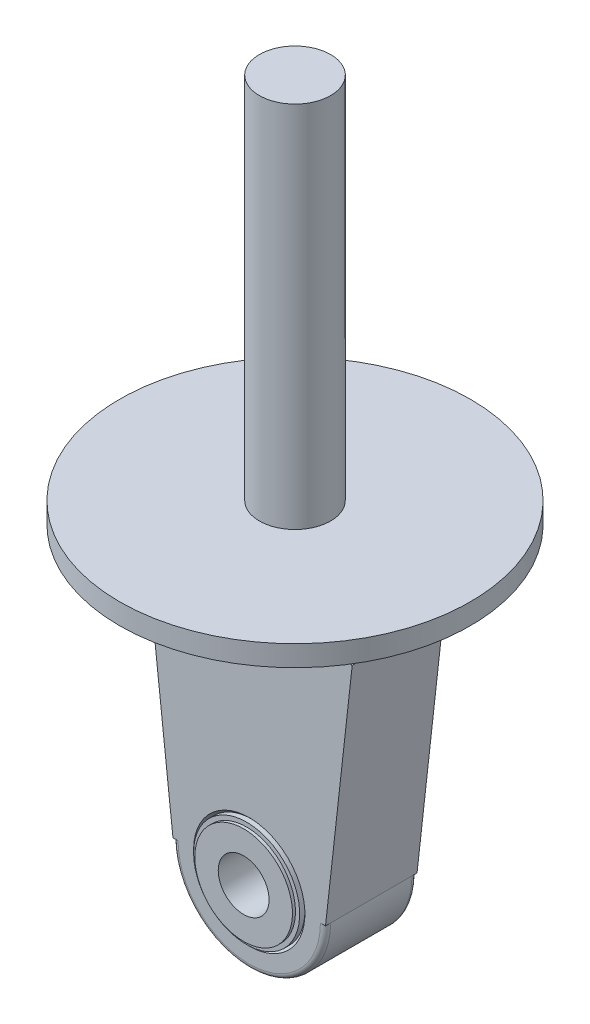
ISO-10303-21;
HEADER;
FILE_DESCRIPTION(('STEP AP214'),'2;1');
FILE_NAME('part.step','',(''),(''),'','','');
FILE_SCHEMA(('AUTOMOTIVE_DESIGN { 1 0 10303 214 1 1 1 1 }'));
ENDSEC;
DATA;
#1=APPLICATION_CONTEXT('core data for automotive mechanical design processes');
#2=APPLICATION_PROTOCOL_DEFINITION('international standard','automotive_design',2000,#1);
#3=PRODUCT_CONTEXT('',#1,'mechanical');
#4=PRODUCT('Part','Part','',(#3));
#5=PRODUCT_RELATED_PRODUCT_CATEGORY('part','',(#4));
#6=PRODUCT_DEFINITION_FORMATION('','',#4);
#7=PRODUCT_DEFINITION_CONTEXT('part definition',#1,'design');
#8=PRODUCT_DEFINITION('design','',#6,#7);
#9=PRODUCT_DEFINITION_SHAPE('','',#8);
#10=(LENGTH_UNIT() NAMED_UNIT(*) SI_UNIT(.MILLI.,.METRE.));
#11=(NAMED_UNIT(*) PLANE_ANGLE_UNIT() SI_UNIT($,.RADIAN.));
#12=(NAMED_UNIT(*) SI_UNIT($,.STERADIAN.) SOLID_ANGLE_UNIT());
#13=UNCERTAINTY_MEASURE_WITH_UNIT(LENGTH_MEASURE(1.E-05),#10,'distance_accuracy_value','');
#14=(GEOMETRIC_REPRESENTATION_CONTEXT(3) GLOBAL_UNCERTAINTY_ASSIGNED_CONTEXT((#13)) GLOBAL_UNIT_ASSIGNED_CONTEXT((#10,
#11,#12)) REPRESENTATION_CONTEXT('',''));
#15=CARTESIAN_POINT('',(0.,0.,0.));
#16=DIRECTION('',(0.,0.,1.));
#17=DIRECTION('',(1.,0.,0.));
#18=AXIS2_PLACEMENT_3D('',#15,#16,#17);
#19=CARTESIAN_POINT('',(-20.25,47.,71.0423242633607));
#20=DIRECTION('',(0.,-1.,0.));
#21=DIRECTION('',(1.,0.,0.));
#22=AXIS2_PLACEMENT_3D('',#19,#20,#21);
#23=PLANE('',#22);
#24=DIRECTION('',(1.,0.,0.));
#25=VECTOR('',#24,1.);
#26=CARTESIAN_POINT('',(-20.25,47.,-9.));
#27=LINE('',#26,#25);
#28=CARTESIAN_POINT('',(18.1400799336717,47.,-9.));
#29=VERTEX_POINT('',#28);
#30=CARTESIAN_POINT('',(20.25,47.,-9.));
#31=VERTEX_POINT('',#30);
#32=EDGE_CURVE('E139',#29,#31,#27,.T.);
#33=ORIENTED_EDGE('',*,*,#32,.F.);
#34=CARTESIAN_POINT('',(0.,47.,0.));
#35=DIRECTION('',(0.,-1.,0.));
#36=DIRECTION('',(0.,0.,-1.));
#37=AXIS2_PLACEMENT_3D('',#34,#35,#36);
#38=CIRCLE('',#37,20.25);
#39=CARTESIAN_POINT('',(20.25,47.,0.));
#40=VERTEX_POINT('',#39);
#41=EDGE_CURVE('E129',#29,#40,#38,.T.);
#42=ORIENTED_EDGE('',*,*,#41,.T.);
#43=DIRECTION('',(0.,0.,-1.));
#44=VECTOR('',#43,1.);
#45=CARTESIAN_POINT('',(20.25,47.,71.0423242633607));
#46=LINE('',#45,#44);
#47=EDGE_CURVE('E140',#40,#31,#46,.T.);
#48=ORIENTED_EDGE('',*,*,#47,.T.);
#49=EDGE_LOOP('',(#33,#42,#48));
#50=FACE_BOUND('',#49,.T.);
#51=ADVANCED_FACE('F40',(#50),#23,.F.);
#52=CARTESIAN_POINT('',(20.25,47.,9.));
#53=VERTEX_POINT('',#52);
#54=EDGE_CURVE('E185',#53,#40,#46,.T.);
#55=ORIENTED_EDGE('',*,*,#54,.T.);
#56=CARTESIAN_POINT('',(18.1400799336717,47.,9.));
#57=VERTEX_POINT('',#56);
#58=EDGE_CURVE('E11',#40,#57,#38,.T.);
#59=ORIENTED_EDGE('',*,*,#58,.T.);
#60=DIRECTION('',(1.,0.,0.));
#61=VECTOR('',#60,1.);
#62=CARTESIAN_POINT('',(-20.25,47.,9.));
#63=LINE('',#62,#61);
#64=EDGE_CURVE('E164',#57,#53,#63,.T.);
#65=ORIENTED_EDGE('',*,*,#64,.T.);
#66=EDGE_LOOP('',(#55,#59,#65));
#67=FACE_BOUND('',#66,.T.);
#68=ADVANCED_FACE('F280',(#67),#23,.F.);
#69=CARTESIAN_POINT('',(-20.25,47.,9.));
#70=VERTEX_POINT('',#69);
#71=CARTESIAN_POINT('',(-18.1400799336717,47.,9.));
#72=VERTEX_POINT('',#71);
#73=EDGE_CURVE('E166',#70,#72,#63,.T.);
#74=ORIENTED_EDGE('',*,*,#73,.T.);
#75=CARTESIAN_POINT('',(-20.25,47.,0.));
#76=VERTEX_POINT('',#75);
#77=EDGE_CURVE('E49',#72,#76,#38,.T.);
#78=ORIENTED_EDGE('',*,*,#77,.T.);
#79=DIRECTION('',(0.,0.,-1.));
#80=VECTOR('',#79,1.);
#81=CARTESIAN_POINT('',(-20.25,47.,71.0423242633607));
#82=LINE('',#81,#80);
#83=EDGE_CURVE('E182',#70,#76,#82,.T.);
#84=ORIENTED_EDGE('',*,*,#83,.F.);
#85=EDGE_LOOP('',(#74,#78,#84));
#86=FACE_BOUND('',#85,.T.);
#87=ADVANCED_FACE('F286',(#86),#23,.F.);
#88=CARTESIAN_POINT('',(0.,0.,-8.));
#89=DIRECTION('',(0.,0.,-1.));
#90=DIRECTION('',(-1.,0.,0.));
#91=AXIS2_PLACEMENT_3D('',#88,#89,#90);
#92=TOROIDAL_SURFACE('',#91,14.,0.999999999999999);
#93=CARTESIAN_POINT('',(-14.,0.,-8.));
#94=DIRECTION('',(0.,1.,0.));
#95=DIRECTION('',(0.,0.,1.));
#96=AXIS2_PLACEMENT_3D('',#93,#94,#95);
#97=CIRCLE('',#96,0.999999999999999);
#98=CARTESIAN_POINT('',(-14.,0.,-9.));
#99=VERTEX_POINT('',#98);
#100=CARTESIAN_POINT('',(-15.,0.,-7.99999999999999));
#101=VERTEX_POINT('',#100);
#102=EDGE_CURVE('E201',#99,#101,#97,.T.);
#103=ORIENTED_EDGE('',*,*,#102,.F.);
#104=CARTESIAN_POINT('',(0.,0.,-9.));
#105=DIRECTION('',(0.,0.,-1.));
#106=DIRECTION('',(-1.,0.,0.));
#107=AXIS2_PLACEMENT_3D('',#104,#105,#106);
#108=CIRCLE('',#107,14.);
#109=CARTESIAN_POINT('',(14.,0.,-9.));
#110=VERTEX_POINT('',#109);
#111=EDGE_CURVE('E66',#110,#99,#108,.T.);
#112=ORIENTED_EDGE('',*,*,#111,.F.);
#113=CARTESIAN_POINT('',(14.,0.,-8.));
#114=DIRECTION('',(0.,1.,0.));
#115=DIRECTION('',(0.,0.,1.));
#116=AXIS2_PLACEMENT_3D('',#113,#114,#115);
#117=CIRCLE('',#116,0.999999999999999);
#118=CARTESIAN_POINT('',(15.,0.,-7.99999999999999));
#119=VERTEX_POINT('',#118);
#120=EDGE_CURVE('E196',#119,#110,#117,.T.);
#121=ORIENTED_EDGE('',*,*,#120,.F.);
#122=CARTESIAN_POINT('',(0.,0.,-7.99999999999999));
#123=DIRECTION('',(0.,0.,-1.));
#124=DIRECTION('',(-1.,0.,0.));
#125=AXIS2_PLACEMENT_3D('',#122,#123,#124);
#126=CIRCLE('',#125,15.);
#127=EDGE_CURVE('E230',#119,#101,#126,.T.);
#128=ORIENTED_EDGE('',*,*,#127,.T.);
#129=EDGE_LOOP('',(#103,#112,#121,#128));
#130=FACE_BOUND('',#129,.T.);
#131=ADVANCED_FACE('F301',(#130),#92,.T.);
#132=CARTESIAN_POINT('',(0.,0.,-9.9453934565152));
#133=DIRECTION('',(0.,0.,-1.));
#134=DIRECTION('',(-1.,0.,0.));
#135=AXIS2_PLACEMENT_3D('',#132,#133,#134);
#136=CYLINDRICAL_SURFACE('',#135,15.);
#137=DIRECTION('',(0.,0.,-1.));
#138=VECTOR('',#137,1.);
#139=CARTESIAN_POINT('',(-15.,0.,71.0423242633607));
#140=LINE('',#139,#138);
#141=CARTESIAN_POINT('',(-15.,0.,7.99999999999999));
#142=VERTEX_POINT('',#141);
#143=EDGE_CURVE('E181',#142,#101,#140,.T.);
#144=ORIENTED_EDGE('',*,*,#143,.T.);
#145=ORIENTED_EDGE('',*,*,#127,.F.);
#146=DIRECTION('',(0.,0.,-1.));
#147=VECTOR('',#146,1.);
#148=CARTESIAN_POINT('',(15.,0.,71.0423242633607));
#149=LINE('',#148,#147);
#150=CARTESIAN_POINT('',(15.,0.,7.99999999999999));
#151=VERTEX_POINT('',#150);
#152=EDGE_CURVE('E192',#151,#119,#149,.T.);
#153=ORIENTED_EDGE('',*,*,#152,.F.);
#154=CARTESIAN_POINT('',(0.,0.,7.99999999999999));
#155=DIRECTION('',(0.,0.,-1.));
#156=DIRECTION('',(-1.,0.,0.));
#157=AXIS2_PLACEMENT_3D('',#154,#155,#156);
#158=CIRCLE('',#157,15.);
#159=EDGE_CURVE('E227',#151,#142,#158,.T.);
#160=ORIENTED_EDGE('',*,*,#159,.T.);
#161=EDGE_LOOP('',(#144,#145,#153,#160));
#162=FACE_BOUND('',#161,.T.);
#163=ADVANCED_FACE('F306',(#162),#136,.T.);
#164=CARTESIAN_POINT('',(0.,0.,8.));
#165=DIRECTION('',(0.,0.,-1.));
#166=DIRECTION('',(-1.,0.,0.));
#167=AXIS2_PLACEMENT_3D('',#164,#165,#166);
#168=TOROIDAL_SURFACE('',#167,14.,0.999999999999999);
#169=CARTESIAN_POINT('',(-14.,0.,8.));
#170=DIRECTION('',(0.,1.,0.));
#171=DIRECTION('',(0.,0.,1.));
#172=AXIS2_PLACEMENT_3D('',#169,#170,#171);
#173=CIRCLE('',#172,0.999999999999999);
#174=CARTESIAN_POINT('',(-14.,0.,9.));
#175=VERTEX_POINT('',#174);
#176=EDGE_CURVE('E198',#142,#175,#173,.T.);
#177=ORIENTED_EDGE('',*,*,#176,.F.);
#178=ORIENTED_EDGE('',*,*,#159,.F.);
#179=CARTESIAN_POINT('',(14.,0.,8.));
#180=DIRECTION('',(0.,1.,0.));
#181=DIRECTION('',(0.,0.,1.));
#182=AXIS2_PLACEMENT_3D('',#179,#180,#181);
#183=CIRCLE('',#182,0.999999999999999);
#184=CARTESIAN_POINT('',(14.,0.,9.));
#185=VERTEX_POINT('',#184);
#186=EDGE_CURVE('E176',#185,#151,#183,.T.);
#187=ORIENTED_EDGE('',*,*,#186,.F.);
#188=CARTESIAN_POINT('',(0.,0.,9.));
#189=DIRECTION('',(0.,0.,-1.));
#190=DIRECTION('',(-1.,0.,0.));
#191=AXIS2_PLACEMENT_3D('',#188,#189,#190);
#192=CIRCLE('',#191,14.);
#193=EDGE_CURVE('E225',#185,#175,#192,.T.);
#194=ORIENTED_EDGE('',*,*,#193,.T.);
#195=EDGE_LOOP('',(#177,#178,#187,#194));
#196=FACE_BOUND('',#195,.T.);
#197=ADVANCED_FACE('F340',(#196),#168,.T.);
#198=CARTESIAN_POINT('',(5.,0.,-10.1));
#199=DIRECTION('',(0.,0.,1.));
#200=DIRECTION('',(1.,0.,0.));
#201=AXIS2_PLACEMENT_3D('',#198,#199,#200);
#202=PLANE('',#201);
#203=CARTESIAN_POINT('',(0.,0.,-10.1));
#204=DIRECTION('',(0.,0.,-1.));
#205=DIRECTION('',(-1.,0.,0.));
#206=AXIS2_PLACEMENT_3D('',#203,#204,#205);
#207=CIRCLE('',#206,5.);
#208=CARTESIAN_POINT('',(-5.,0.,-10.1));
#209=VERTEX_POINT('',#208);
#210=EDGE_CURVE('E204',#209,#209,#207,.T.);
#211=ORIENTED_EDGE('',*,*,#210,.F.);
#212=EDGE_LOOP('',(#211));
#213=FACE_BOUND('',#212,.T.);
#214=CARTESIAN_POINT('',(0.,0.,-10.1));
#215=DIRECTION('',(0.,0.,-1.));
#216=DIRECTION('',(-1.,0.,0.));
#217=AXIS2_PLACEMENT_3D('',#214,#215,#216);
#218=CIRCLE('',#217,9.6);
#219=CARTESIAN_POINT('',(-9.6,0.,-10.1));
#220=VERTEX_POINT('',#219);
#221=EDGE_CURVE('E44',#220,#220,#218,.T.);
#222=ORIENTED_EDGE('',*,*,#221,.T.);
#223=EDGE_LOOP('',(#222));
#224=FACE_BOUND('',#223,.T.);
#225=ADVANCED_FACE('F42',(#213,#224),#202,.F.);
#226=CARTESIAN_POINT('',(0.,0.,-9.9453934565152));
#227=DIRECTION('',(0.,0.,-1.));
#228=DIRECTION('',(-1.,0.,0.));
#229=AXIS2_PLACEMENT_3D('',#226,#227,#228);
#230=CYLINDRICAL_SURFACE('',#229,9.6);
#231=ORIENTED_EDGE('',*,*,#221,.F.);
#232=EDGE_LOOP('',(#231));
#233=FACE_BOUND('',#232,.T.);
#234=CARTESIAN_POINT('',(0.,0.,-9.5102399041044));
#235=DIRECTION('',(0.,0.,-1.));
#236=DIRECTION('',(-1.,0.,0.));
#237=AXIS2_PLACEMENT_3D('',#234,#235,#236);
#238=CIRCLE('',#237,9.6);
#239=CARTESIAN_POINT('',(-9.6,0.,-9.5102399041044));
#240=VERTEX_POINT('',#239);
#241=EDGE_CURVE('E242',#240,#240,#238,.T.);
#242=ORIENTED_EDGE('',*,*,#241,.T.);
#243=EDGE_LOOP('',(#242));
#244=FACE_BOUND('',#243,.T.);
#245=ADVANCED_FACE('F391',(#233,#244),#230,.T.);
#246=CARTESIAN_POINT('',(9.6,0.,-9.5102399041044));
#247=DIRECTION('',(0.,0.,1.));
#248=DIRECTION('',(1.,0.,0.));
#249=AXIS2_PLACEMENT_3D('',#246,#247,#248);
#250=PLANE('',#249);
#251=ORIENTED_EDGE('',*,*,#241,.F.);
#252=EDGE_LOOP('',(#251));
#253=FACE_BOUND('',#252,.T.);
#254=CARTESIAN_POINT('',(0.,0.,-9.5102399041044));
#255=DIRECTION('',(0.,0.,-1.));
#256=DIRECTION('',(-1.,0.,0.));
#257=AXIS2_PLACEMENT_3D('',#254,#255,#256);
#258=CIRCLE('',#257,10.4330771851757);
#259=CARTESIAN_POINT('',(-10.4330771851757,0.,-9.5102399041044));
#260=VERTEX_POINT('',#259);
#261=EDGE_CURVE('E240',#260,#260,#258,.T.);
#262=ORIENTED_EDGE('',*,*,#261,.T.);
#263=EDGE_LOOP('',(#262));
#264=FACE_BOUND('',#263,.T.);
#265=ADVANCED_FACE('F388',(#253,#264),#250,.F.);
#266=CARTESIAN_POINT('',(0.,0.,-9.9453934565152));
#267=DIRECTION('',(0.,0.,-1.));
#268=DIRECTION('',(-1.,0.,0.));
#269=AXIS2_PLACEMENT_3D('',#266,#267,#268);
#270=CYLINDRICAL_SURFACE('',#269,10.4330771851757);
#271=ORIENTED_EDGE('',*,*,#261,.F.);
#272=EDGE_LOOP('',(#271));
#273=FACE_BOUND('',#272,.T.);
#274=CARTESIAN_POINT('',(0.,0.,-8.48743323040157));
#275=DIRECTION('',(0.,0.,-1.));
#276=DIRECTION('',(-1.,0.,0.));
#277=AXIS2_PLACEMENT_3D('',#274,#275,#276);
#278=CIRCLE('',#277,10.4330771851757);
#279=CARTESIAN_POINT('',(-10.4330771851757,0.,-8.48743323040157));
#280=VERTEX_POINT('',#279);
#281=EDGE_CURVE('E237',#280,#280,#278,.T.);
#282=ORIENTED_EDGE('',*,*,#281,.T.);
#283=EDGE_LOOP('',(#282));
#284=FACE_BOUND('',#283,.T.);
#285=ADVANCED_FACE('F384',(#273,#284),#270,.T.);
#286=CARTESIAN_POINT('',(0.,0.,-9.));
#287=DIRECTION('',(0.,0.,-1.));
#288=DIRECTION('',(-1.,0.,0.));
#289=AXIS2_PLACEMENT_3D('',#286,#287,#288);
#290=CONICAL_SURFACE('',#289,10.9456439547741,0.785398163397447);
#291=ORIENTED_EDGE('',*,*,#281,.F.);
#292=EDGE_LOOP('',(#291));
#293=FACE_BOUND('',#292,.T.);
#294=CARTESIAN_POINT('',(0.,0.,-9.));
#295=DIRECTION('',(0.,0.,-1.));
#296=DIRECTION('',(-1.,0.,0.));
#297=AXIS2_PLACEMENT_3D('',#294,#295,#296);
#298=CIRCLE('',#297,10.9456439547741);
#299=CARTESIAN_POINT('',(-10.9456439547741,0.,-9.));
#300=VERTEX_POINT('',#299);
#301=EDGE_CURVE('E234',#300,#300,#298,.T.);
#302=ORIENTED_EDGE('',*,*,#301,.T.);
#303=EDGE_LOOP('',(#302));
#304=FACE_BOUND('',#303,.T.);
#305=ADVANCED_FACE('F381',(#293,#304),#290,.F.);
#306=CARTESIAN_POINT('',(10.9456439547741,0.,-9.));
#307=DIRECTION('',(0.,0.,1.));
#308=DIRECTION('',(1.,0.,0.));
#309=AXIS2_PLACEMENT_3D('',#306,#307,#308);
#310=PLANE('',#309);
#311=ORIENTED_EDGE('',*,*,#111,.T.);
#312=DIRECTION('',(-1.,0.,0.));
#313=VECTOR('',#312,1.);
#314=CARTESIAN_POINT('',(-15.,0.,-9.));
#315=LINE('',#314,#313);
#316=CARTESIAN_POINT('',(-15.,0.,-9.));
#317=VERTEX_POINT('',#316);
#318=EDGE_CURVE('E155',#99,#317,#315,.T.);
#319=ORIENTED_EDGE('',*,*,#318,.T.);
#320=DIRECTION('',(-0.111011707821466,0.993819098592174,0.));
#321=VECTOR('',#320,1.);
#322=CARTESIAN_POINT('',(-20.25,47.,-9.));
#323=LINE('',#322,#321);
#324=CARTESIAN_POINT('',(-20.25,47.,-9.));
#325=VERTEX_POINT('',#324);
#326=EDGE_CURVE('E151',#317,#325,#323,.T.);
#327=ORIENTED_EDGE('',*,*,#326,.T.);
#328=CARTESIAN_POINT('',(-18.1400799336717,47.,-9.));
#329=VERTEX_POINT('',#328);
#330=EDGE_CURVE('E145',#325,#329,#27,.T.);
#331=ORIENTED_EDGE('',*,*,#330,.T.);
#332=EDGE_CURVE('E126',#329,#29,#27,.T.);
#333=ORIENTED_EDGE('',*,*,#332,.T.);
#334=ORIENTED_EDGE('',*,*,#32,.T.);
#335=DIRECTION('',(-0.111011707821466,-0.993819098592174,0.));
#336=VECTOR('',#335,1.);
#337=CARTESIAN_POINT('',(20.25,47.,-9.));
#338=LINE('',#337,#336);
#339=CARTESIAN_POINT('',(15.,0.,-9.00000000000001));
#340=VERTEX_POINT('',#339);
#341=EDGE_CURVE('E137',#31,#340,#338,.T.);
#342=ORIENTED_EDGE('',*,*,#341,.T.);
#343=DIRECTION('',(-1.,0.,0.));
#344=VECTOR('',#343,1.);
#345=CARTESIAN_POINT('',(15.,0.,-9.));
#346=LINE('',#345,#344);
#347=EDGE_CURVE('E157',#340,#110,#346,.T.);
#348=ORIENTED_EDGE('',*,*,#347,.T.);
#349=EDGE_LOOP('',(#311,#319,#327,#331,#333,#334,#342,#348));
#350=FACE_BOUND('',#349,.T.);
#351=ORIENTED_EDGE('',*,*,#301,.F.);
#352=EDGE_LOOP('',(#351));
#353=FACE_BOUND('',#352,.T.);
#354=ADVANCED_FACE('F147',(#350,#353),#310,.F.);
#355=CARTESIAN_POINT('',(10.9456439547741,0.,9.));
#356=DIRECTION('',(0.,0.,-1.));
#357=DIRECTION('',(-1.,0.,0.));
#358=AXIS2_PLACEMENT_3D('',#355,#356,#357);
#359=PLANE('',#358);
#360=CARTESIAN_POINT('',(0.,0.,9.));
#361=DIRECTION('',(0.,0.,-1.));
#362=DIRECTION('',(-1.,0.,0.));
#363=AXIS2_PLACEMENT_3D('',#360,#361,#362);
#364=CIRCLE('',#363,10.9456439547741);
#365=CARTESIAN_POINT('',(-10.9456439547741,0.,9.));
#366=VERTEX_POINT('',#365);
#367=EDGE_CURVE('E222',#366,#366,#364,.T.);
#368=ORIENTED_EDGE('',*,*,#367,.T.);
#369=EDGE_LOOP('',(#368));
#370=FACE_BOUND('',#369,.T.);
#371=ORIENTED_EDGE('',*,*,#193,.F.);
#372=DIRECTION('',(-1.,0.,0.));
#373=VECTOR('',#372,1.);
#374=CARTESIAN_POINT('',(15.,0.,9.));
#375=LINE('',#374,#373);
#376=CARTESIAN_POINT('',(15.,0.,9.));
#377=VERTEX_POINT('',#376);
#378=EDGE_CURVE('E173',#377,#185,#375,.T.);
#379=ORIENTED_EDGE('',*,*,#378,.F.);
#380=DIRECTION('',(-0.111011707821466,-0.993819098592174,0.));
#381=VECTOR('',#380,1.);
#382=CARTESIAN_POINT('',(20.25,47.,9.));
#383=LINE('',#382,#381);
#384=EDGE_CURVE('E169',#53,#377,#383,.T.);
#385=ORIENTED_EDGE('',*,*,#384,.F.);
#386=ORIENTED_EDGE('',*,*,#64,.F.);
#387=EDGE_CURVE('E170',#72,#57,#63,.T.);
#388=ORIENTED_EDGE('',*,*,#387,.F.);
#389=ORIENTED_EDGE('',*,*,#73,.F.);
#390=DIRECTION('',(-0.111011707821466,0.993819098592174,0.));
#391=VECTOR('',#390,1.);
#392=CARTESIAN_POINT('',(-20.25,47.,9.));
#393=LINE('',#392,#391);
#394=CARTESIAN_POINT('',(-15.,0.,9.00000000000001));
#395=VERTEX_POINT('',#394);
#396=EDGE_CURVE('E161',#395,#70,#393,.T.);
#397=ORIENTED_EDGE('',*,*,#396,.F.);
#398=DIRECTION('',(-1.,0.,0.));
#399=VECTOR('',#398,1.);
#400=CARTESIAN_POINT('',(-15.,0.,9.));
#401=LINE('',#400,#399);
#402=EDGE_CURVE('E165',#175,#395,#401,.T.);
#403=ORIENTED_EDGE('',*,*,#402,.F.);
#404=EDGE_LOOP('',(#371,#379,#385,#386,#388,#389,#397,#403));
#405=FACE_BOUND('',#404,.T.);
#406=ADVANCED_FACE('F312',(#370,#405),#359,.F.);
#407=CARTESIAN_POINT('',(0.,0.,8.48743323040157));
#408=DIRECTION('',(0.,0.,1.));
#409=DIRECTION('',(1.,0.,0.));
#410=AXIS2_PLACEMENT_3D('',#407,#408,#409);
#411=CONICAL_SURFACE('',#410,10.4330771851757,0.785398163397445);
#412=ORIENTED_EDGE('',*,*,#367,.F.);
#413=EDGE_LOOP('',(#412));
#414=FACE_BOUND('',#413,.T.);
#415=CARTESIAN_POINT('',(0.,0.,8.48743323040157));
#416=DIRECTION('',(0.,0.,-1.));
#417=DIRECTION('',(-1.,0.,0.));
#418=AXIS2_PLACEMENT_3D('',#415,#416,#417);
#419=CIRCLE('',#418,10.4330771851757);
#420=CARTESIAN_POINT('',(-10.4330771851757,0.,8.48743323040157));
#421=VERTEX_POINT('',#420);
#422=EDGE_CURVE('E219',#421,#421,#419,.T.);
#423=ORIENTED_EDGE('',*,*,#422,.T.);
#424=EDGE_LOOP('',(#423));
#425=FACE_BOUND('',#424,.T.);
#426=ADVANCED_FACE('F367',(#414,#425),#411,.F.);
#427=CARTESIAN_POINT('',(0.,0.,-9.9453934565152));
#428=DIRECTION('',(0.,0.,-1.));
#429=DIRECTION('',(-1.,0.,0.));
#430=AXIS2_PLACEMENT_3D('',#427,#428,#429);
#431=CYLINDRICAL_SURFACE('',#430,10.4330771851757);
#432=ORIENTED_EDGE('',*,*,#422,.F.);
#433=EDGE_LOOP('',(#432));
#434=FACE_BOUND('',#433,.T.);
#435=CARTESIAN_POINT('',(0.,0.,9.51023990410441));
#436=DIRECTION('',(0.,0.,-1.));
#437=DIRECTION('',(-1.,0.,0.));
#438=AXIS2_PLACEMENT_3D('',#435,#436,#437);
#439=CIRCLE('',#438,10.4330771851757);
#440=CARTESIAN_POINT('',(-10.4330771851757,0.,9.51023990410441));
#441=VERTEX_POINT('',#440);
#442=EDGE_CURVE('E216',#441,#441,#439,.T.);
#443=ORIENTED_EDGE('',*,*,#442,.T.);
#444=EDGE_LOOP('',(#443));
#445=FACE_BOUND('',#444,.T.);
#446=ADVANCED_FACE('F363',(#434,#445),#431,.T.);
#447=CARTESIAN_POINT('',(9.6,0.,9.5102399041044));
#448=DIRECTION('',(0.,0.,-1.));
#449=DIRECTION('',(-1.,0.,0.));
#450=AXIS2_PLACEMENT_3D('',#447,#448,#449);
#451=PLANE('',#450);
#452=ORIENTED_EDGE('',*,*,#442,.F.);
#453=EDGE_LOOP('',(#452));
#454=FACE_BOUND('',#453,.T.);
#455=CARTESIAN_POINT('',(0.,0.,9.51023990410441));
#456=DIRECTION('',(0.,0.,-1.));
#457=DIRECTION('',(-1.,0.,0.));
#458=AXIS2_PLACEMENT_3D('',#455,#456,#457);
#459=CIRCLE('',#458,9.6);
#460=CARTESIAN_POINT('',(-9.6,0.,9.51023990410441));
#461=VERTEX_POINT('',#460);
#462=EDGE_CURVE('E213',#461,#461,#459,.T.);
#463=ORIENTED_EDGE('',*,*,#462,.T.);
#464=EDGE_LOOP('',(#463));
#465=FACE_BOUND('',#464,.T.);
#466=ADVANCED_FACE('F359',(#454,#465),#451,.F.);
#467=CARTESIAN_POINT('',(0.,0.,-9.9453934565152));
#468=DIRECTION('',(0.,0.,-1.));
#469=DIRECTION('',(-1.,0.,0.));
#470=AXIS2_PLACEMENT_3D('',#467,#468,#469);
#471=CYLINDRICAL_SURFACE('',#470,9.6);
#472=ORIENTED_EDGE('',*,*,#462,.F.);
#473=EDGE_LOOP('',(#472));
#474=FACE_BOUND('',#473,.T.);
#475=CARTESIAN_POINT('',(0.,0.,10.1));
#476=DIRECTION('',(0.,0.,-1.));
#477=DIRECTION('',(-1.,0.,0.));
#478=AXIS2_PLACEMENT_3D('',#475,#476,#477);
#479=CIRCLE('',#478,9.6);
#480=CARTESIAN_POINT('',(-9.6,0.,10.1));
#481=VERTEX_POINT('',#480);
#482=EDGE_CURVE('E210',#481,#481,#479,.T.);
#483=ORIENTED_EDGE('',*,*,#482,.T.);
#484=EDGE_LOOP('',(#483));
#485=FACE_BOUND('',#484,.T.);
#486=ADVANCED_FACE('F355',(#474,#485),#471,.T.);
#487=CARTESIAN_POINT('',(5.,0.,10.1));
#488=DIRECTION('',(0.,0.,-1.));
#489=DIRECTION('',(-1.,0.,0.));
#490=AXIS2_PLACEMENT_3D('',#487,#488,#489);
#491=PLANE('',#490);
#492=ORIENTED_EDGE('',*,*,#482,.F.);
#493=EDGE_LOOP('',(#492));
#494=FACE_BOUND('',#493,.T.);
#495=CARTESIAN_POINT('',(0.,0.,10.1));
#496=DIRECTION('',(0.,0.,-1.));
#497=DIRECTION('',(-1.,0.,0.));
#498=AXIS2_PLACEMENT_3D('',#495,#496,#497);
#499=CIRCLE('',#498,5.);
#500=CARTESIAN_POINT('',(-5.,0.,10.1));
#501=VERTEX_POINT('',#500);
#502=EDGE_CURVE('E207',#501,#501,#499,.T.);
#503=ORIENTED_EDGE('',*,*,#502,.T.);
#504=EDGE_LOOP('',(#503));
#505=FACE_BOUND('',#504,.T.);
#506=ADVANCED_FACE('F351',(#494,#505),#491,.F.);
#507=CARTESIAN_POINT('',(0.,0.,-9.9453934565152));
#508=DIRECTION('',(0.,0.,-1.));
#509=DIRECTION('',(-1.,0.,0.));
#510=AXIS2_PLACEMENT_3D('',#507,#508,#509);
#511=CYLINDRICAL_SURFACE('',#510,5.);
#512=ORIENTED_EDGE('',*,*,#502,.F.);
#513=EDGE_LOOP('',(#512));
#514=FACE_BOUND('',#513,.T.);
#515=ORIENTED_EDGE('',*,*,#210,.T.);
#516=EDGE_LOOP('',(#515));
#517=FACE_BOUND('',#516,.T.);
#518=ADVANCED_FACE('F348',(#514,#517),#511,.F.);
#519=CARTESIAN_POINT('',(-15.,0.,71.0423242633607));
#520=DIRECTION('',(0.,1.,0.));
#521=DIRECTION('',(0.,0.,1.));
#522=AXIS2_PLACEMENT_3D('',#519,#520,#521);
#523=PLANE('',#522);
#524=ORIENTED_EDGE('',*,*,#318,.F.);
#525=ORIENTED_EDGE('',*,*,#102,.T.);
#526=EDGE_CURVE('E160',#101,#317,#140,.T.);
#527=ORIENTED_EDGE('',*,*,#526,.T.);
#528=EDGE_LOOP('',(#524,#525,#527));
#529=FACE_BOUND('',#528,.T.);
#530=ADVANCED_FACE('F335',(#529),#523,.F.);
#531=EDGE_CURVE('E177',#395,#142,#140,.T.);
#532=ORIENTED_EDGE('',*,*,#531,.T.);
#533=ORIENTED_EDGE('',*,*,#176,.T.);
#534=ORIENTED_EDGE('',*,*,#402,.T.);
#535=EDGE_LOOP('',(#532,#533,#534));
#536=FACE_BOUND('',#535,.T.);
#537=ADVANCED_FACE('F337',(#536),#523,.F.);
#538=CARTESIAN_POINT('',(15.,0.,71.0423242633607));
#539=DIRECTION('',(0.,1.,0.));
#540=DIRECTION('',(0.,0.,1.));
#541=AXIS2_PLACEMENT_3D('',#538,#539,#540);
#542=PLANE('',#541);
#543=EDGE_CURVE('E188',#119,#340,#149,.T.);
#544=ORIENTED_EDGE('',*,*,#543,.F.);
#545=ORIENTED_EDGE('',*,*,#120,.T.);
#546=ORIENTED_EDGE('',*,*,#347,.F.);
#547=EDGE_LOOP('',(#544,#545,#546));
#548=FACE_BOUND('',#547,.T.);
#549=ADVANCED_FACE('F325',(#548),#542,.F.);
#550=ORIENTED_EDGE('',*,*,#378,.T.);
#551=ORIENTED_EDGE('',*,*,#186,.T.);
#552=EDGE_CURVE('E189',#377,#151,#149,.T.);
#553=ORIENTED_EDGE('',*,*,#552,.F.);
#554=EDGE_LOOP('',(#550,#551,#553));
#555=FACE_BOUND('',#554,.T.);
#556=ADVANCED_FACE('F298',(#555),#542,.F.);
#557=CARTESIAN_POINT('',(-20.25,47.,71.0423242633607));
#558=DIRECTION('',(0.993819098592174,0.111011707821466,0.));
#559=DIRECTION('',(-0.111011707821466,0.993819098592174,0.));
#560=AXIS2_PLACEMENT_3D('',#557,#558,#559);
#561=PLANE('',#560);
#562=ORIENTED_EDGE('',*,*,#531,.F.);
#563=ORIENTED_EDGE('',*,*,#396,.T.);
#564=ORIENTED_EDGE('',*,*,#83,.T.);
#565=EDGE_CURVE('E180',#76,#325,#82,.T.);
#566=ORIENTED_EDGE('',*,*,#565,.T.);
#567=ORIENTED_EDGE('',*,*,#326,.F.);
#568=ORIENTED_EDGE('',*,*,#526,.F.);
#569=ORIENTED_EDGE('',*,*,#143,.F.);
#570=EDGE_LOOP('',(#562,#563,#564,#566,#567,#568,#569));
#571=FACE_BOUND('',#570,.T.);
#572=ADVANCED_FACE('F292',(#571),#561,.F.);
#573=ORIENTED_EDGE('',*,*,#565,.F.);
#574=EDGE_CURVE('E138',#76,#329,#38,.T.);
#575=ORIENTED_EDGE('',*,*,#574,.T.);
#576=ORIENTED_EDGE('',*,*,#330,.F.);
#577=EDGE_LOOP('',(#573,#575,#576));
#578=FACE_BOUND('',#577,.T.);
#579=ADVANCED_FACE('F282',(#578),#23,.F.);
#580=CARTESIAN_POINT('',(20.25,47.,71.0423242633607));
#581=DIRECTION('',(-0.993819098592174,0.111011707821466,0.));
#582=DIRECTION('',(-0.111011707821466,-0.993819098592174,0.));
#583=AXIS2_PLACEMENT_3D('',#580,#581,#582);
#584=PLANE('',#583);
#585=ORIENTED_EDGE('',*,*,#54,.F.);
#586=ORIENTED_EDGE('',*,*,#384,.T.);
#587=ORIENTED_EDGE('',*,*,#552,.T.);
#588=ORIENTED_EDGE('',*,*,#152,.T.);
#589=ORIENTED_EDGE('',*,*,#543,.T.);
#590=ORIENTED_EDGE('',*,*,#341,.F.);
#591=ORIENTED_EDGE('',*,*,#47,.F.);
#592=EDGE_LOOP('',(#585,#586,#587,#588,#589,#590,#591));
#593=FACE_BOUND('',#592,.T.);
#594=ADVANCED_FACE('F291',(#593),#584,.F.);
#595=CARTESIAN_POINT('',(0.,47.,0.));
#596=DIRECTION('',(0.,-1.,0.));
#597=DIRECTION('',(0.,0.,-1.));
#598=AXIS2_PLACEMENT_3D('',#595,#596,#597);
#599=PLANE('',#598);
#600=ORIENTED_EDGE('',*,*,#332,.F.);
#601=EDGE_CURVE('E58',#329,#29,#38,.T.);
#602=ORIENTED_EDGE('',*,*,#601,.T.);
#603=EDGE_LOOP('',(#600,#602));
#604=FACE_BOUND('',#603,.T.);
#605=ADVANCED_FACE('F124',(#604),#599,.T.);
#606=EDGE_CURVE('E51',#57,#72,#38,.T.);
#607=ORIENTED_EDGE('',*,*,#606,.T.);
#608=ORIENTED_EDGE('',*,*,#387,.T.);
#609=EDGE_LOOP('',(#607,#608));
#610=FACE_BOUND('',#609,.T.);
#611=ADVANCED_FACE('F564',(#610),#599,.T.);
#612=CARTESIAN_POINT('',(0.,0.,0.));
#613=DIRECTION('',(0.,-1.,0.));
#614=DIRECTION('',(0.,0.,-1.));
#615=AXIS2_PLACEMENT_3D('',#612,#613,#614);
#616=CYLINDRICAL_SURFACE('',#615,20.25);
#617=CARTESIAN_POINT('',(0.,53.1008253132955,0.));
#618=DIRECTION('',(0.,-1.,0.));
#619=DIRECTION('',(0.,0.,-1.));
#620=AXIS2_PLACEMENT_3D('',#617,#618,#619);
#621=CIRCLE('',#620,20.25);
#622=CARTESIAN_POINT('',(0.,53.1008253132955,-20.25));
#623=VERTEX_POINT('',#622);
#624=EDGE_CURVE('E128',#623,#623,#621,.T.);
#625=ORIENTED_EDGE('',*,*,#624,.T.);
#626=EDGE_LOOP('',(#625));
#627=FACE_BOUND('',#626,.T.);
#628=ORIENTED_EDGE('',*,*,#41,.F.);
#629=ORIENTED_EDGE('',*,*,#601,.F.);
#630=ORIENTED_EDGE('',*,*,#574,.F.);
#631=ORIENTED_EDGE('',*,*,#77,.F.);
#632=ORIENTED_EDGE('',*,*,#606,.F.);
#633=ORIENTED_EDGE('',*,*,#58,.F.);
#634=EDGE_LOOP('',(#628,#629,#630,#631,#632,#633));
#635=FACE_BOUND('',#634,.T.);
#636=ADVANCED_FACE('F132',(#627,#635),#616,.T.);
#637=CARTESIAN_POINT('',(0.,53.1008253132955,0.));
#638=DIRECTION('',(0.,1.,0.));
#639=DIRECTION('',(0.,0.,1.));
#640=AXIS2_PLACEMENT_3D('',#637,#638,#639);
#641=CONICAL_SURFACE('',#640,20.25,1.34579251778932);
#642=CARTESIAN_POINT('',(0.,56.3623564604478,0.));
#643=DIRECTION('',(0.,-1.,0.));
#644=DIRECTION('',(0.,0.,-1.));
#645=AXIS2_PLACEMENT_3D('',#642,#643,#644);
#646=CIRCLE('',#645,34.5);
#647=CARTESIAN_POINT('',(0.,56.3623564604478,-34.5));
#648=VERTEX_POINT('',#647);
#649=EDGE_CURVE('E255',#648,#648,#646,.T.);
#650=ORIENTED_EDGE('',*,*,#649,.T.);
#651=EDGE_LOOP('',(#650));
#652=FACE_BOUND('',#651,.T.);
#653=ORIENTED_EDGE('',*,*,#624,.F.);
#654=EDGE_LOOP('',(#653));
#655=FACE_BOUND('',#654,.T.);
#656=ADVANCED_FACE('F580',(#652,#655),#641,.T.);
#657=CARTESIAN_POINT('',(0.,0.,0.));
#658=DIRECTION('',(0.,-1.,0.));
#659=DIRECTION('',(0.,0.,-1.));
#660=AXIS2_PLACEMENT_3D('',#657,#658,#659);
#661=CYLINDRICAL_SURFACE('',#660,34.5);
#662=CARTESIAN_POINT('',(0.,60.45,0.));
#663=DIRECTION('',(0.,-1.,0.));
#664=DIRECTION('',(0.,0.,-1.));
#665=AXIS2_PLACEMENT_3D('',#662,#663,#664);
#666=CIRCLE('',#665,34.5);
#667=CARTESIAN_POINT('',(0.,60.45,-34.5));
#668=VERTEX_POINT('',#667);
#669=EDGE_CURVE('E258',#668,#668,#666,.T.);
#670=ORIENTED_EDGE('',*,*,#669,.T.);
#671=EDGE_LOOP('',(#670));
#672=FACE_BOUND('',#671,.T.);
#673=ORIENTED_EDGE('',*,*,#649,.F.);
#674=EDGE_LOOP('',(#673));
#675=FACE_BOUND('',#674,.T.);
#676=ADVANCED_FACE('F590',(#672,#675),#661,.T.);
#677=CARTESIAN_POINT('',(34.5,60.45,0.));
#678=DIRECTION('',(0.,1.,0.));
#679=DIRECTION('',(0.,0.,1.));
#680=AXIS2_PLACEMENT_3D('',#677,#678,#679);
#681=PLANE('',#680);
#682=CARTESIAN_POINT('',(0.,60.45,0.));
#683=DIRECTION('',(0.,-1.,0.));
#684=DIRECTION('',(0.,0.,-1.));
#685=AXIS2_PLACEMENT_3D('',#682,#683,#684);
#686=CIRCLE('',#685,7.);
#687=CARTESIAN_POINT('',(0.,60.45,-7.));
#688=VERTEX_POINT('',#687);
#689=EDGE_CURVE('E261',#688,#688,#686,.T.);
#690=ORIENTED_EDGE('',*,*,#689,.T.);
#691=EDGE_LOOP('',(#690));
#692=FACE_BOUND('',#691,.T.);
#693=ORIENTED_EDGE('',*,*,#669,.F.);
#694=EDGE_LOOP('',(#693));
#695=FACE_BOUND('',#694,.T.);
#696=ADVANCED_FACE('F277',(#692,#695),#681,.T.);
#697=CARTESIAN_POINT('',(0.,0.,0.));
#698=DIRECTION('',(0.,-1.,0.));
#699=DIRECTION('',(0.,0.,-1.));
#700=AXIS2_PLACEMENT_3D('',#697,#698,#699);
#701=CYLINDRICAL_SURFACE('',#700,7.);
#702=CARTESIAN_POINT('',(0.,132.908961398481,0.));
#703=DIRECTION('',(0.,-1.,0.));
#704=DIRECTION('',(0.,0.,-1.));
#705=AXIS2_PLACEMENT_3D('',#702,#703,#704);
#706=CIRCLE('',#705,7.);
#707=CARTESIAN_POINT('',(0.,132.908961398481,-7.));
#708=VERTEX_POINT('',#707);
#709=EDGE_CURVE('E264',#708,#708,#706,.T.);
#710=ORIENTED_EDGE('',*,*,#709,.T.);
#711=EDGE_LOOP('',(#710));
#712=FACE_BOUND('',#711,.T.);
#713=ORIENTED_EDGE('',*,*,#689,.F.);
#714=EDGE_LOOP('',(#713));
#715=FACE_BOUND('',#714,.T.);
#716=ADVANCED_FACE('F268',(#712,#715),#701,.T.);
#717=CARTESIAN_POINT('',(7.,132.908961398481,0.));
#718=DIRECTION('',(0.,1.,0.));
#719=DIRECTION('',(0.,0.,1.));
#720=AXIS2_PLACEMENT_3D('',#717,#718,#719);
#721=PLANE('',#720);
#722=ORIENTED_EDGE('',*,*,#709,.F.);
#723=EDGE_LOOP('',(#722));
#724=FACE_BOUND('',#723,.T.);
#725=ADVANCED_FACE('F271',(#724),#721,.T.);
#726=CLOSED_SHELL('',(#51,#68,#87,#131,#163,#197,#225,#245,#265,#285,#305,#354,#406,#426,#446,
#466,#486,#506,#518,#530,#537,#549,#556,#572,#579,#594,#605,#611,#636,#656,#676,#696,#716,#725));
#727=MANIFOLD_SOLID_BREP('B2',#726);
#728=ADVANCED_BREP_SHAPE_REPRESENTATION('',(#18,#727),#14);
#729=SHAPE_DEFINITION_REPRESENTATION(#9,#728);
ENDSEC;
END-ISO-10303-21;
